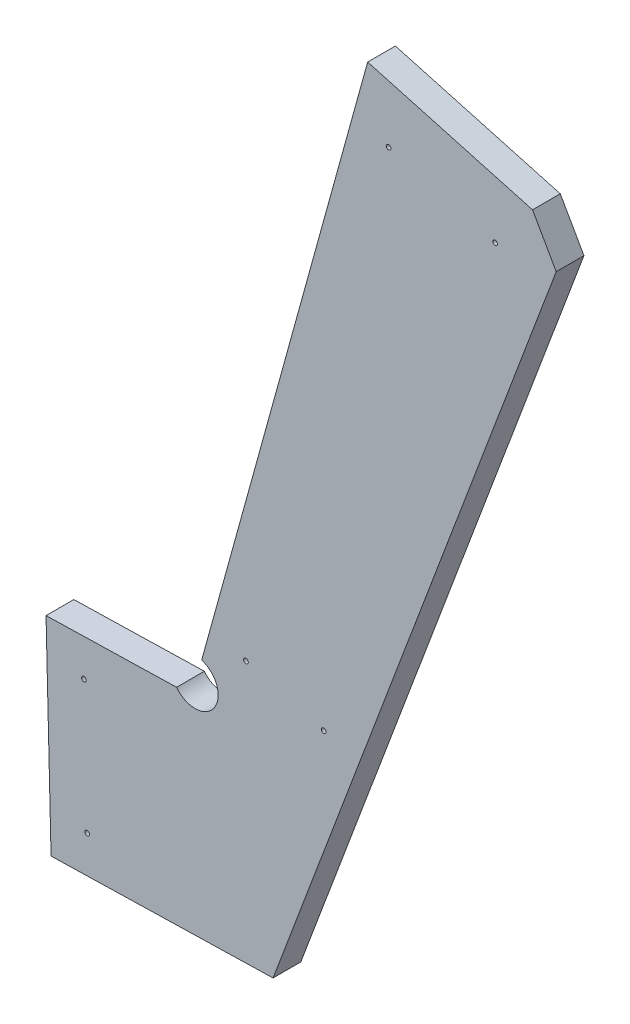
ISO-10303-21;
HEADER;
FILE_DESCRIPTION(('STEP AP214'),'2;1');
FILE_NAME('part.step','',(''),(''),'','','');
FILE_SCHEMA(('AUTOMOTIVE_DESIGN { 1 0 10303 214 1 1 1 1 }'));
ENDSEC;
DATA;
#1=APPLICATION_CONTEXT('core data for automotive mechanical design processes');
#2=APPLICATION_PROTOCOL_DEFINITION('international standard','automotive_design',2000,#1);
#3=PRODUCT_CONTEXT('',#1,'mechanical');
#4=PRODUCT('Part','Part','',(#3));
#5=PRODUCT_RELATED_PRODUCT_CATEGORY('part','',(#4));
#6=PRODUCT_DEFINITION_FORMATION('','',#4);
#7=PRODUCT_DEFINITION_CONTEXT('part definition',#1,'design');
#8=PRODUCT_DEFINITION('design','',#6,#7);
#9=PRODUCT_DEFINITION_SHAPE('','',#8);
#10=(LENGTH_UNIT() NAMED_UNIT(*) SI_UNIT(.MILLI.,.METRE.));
#11=(NAMED_UNIT(*) PLANE_ANGLE_UNIT() SI_UNIT($,.RADIAN.));
#12=(NAMED_UNIT(*) SI_UNIT($,.STERADIAN.) SOLID_ANGLE_UNIT());
#13=UNCERTAINTY_MEASURE_WITH_UNIT(LENGTH_MEASURE(1.E-05),#10,'distance_accuracy_value','');
#14=(GEOMETRIC_REPRESENTATION_CONTEXT(3) GLOBAL_UNCERTAINTY_ASSIGNED_CONTEXT((#13)) GLOBAL_UNIT_ASSIGNED_CONTEXT((#10,
#11,#12)) REPRESENTATION_CONTEXT('',''));
#15=CARTESIAN_POINT('',(0.,0.,0.));
#16=DIRECTION('',(0.,0.,1.));
#17=DIRECTION('',(1.,0.,0.));
#18=AXIS2_PLACEMENT_3D('',#15,#16,#17);
#19=CARTESIAN_POINT('',(175.093421906188,-22.8896132008156,19.05));
#20=DIRECTION('',(0.963909776161033,-0.266229118281957,0.));
#21=DIRECTION('',(0.266229118281958,0.963909776161034,0.));
#22=AXIS2_PLACEMENT_3D('',#19,#20,#21);
#23=PLANE('',#22);
#24=CARTESIAN_POINT('',(145.805415389945,-128.929838956195,9.52499999999995));
#25=DIRECTION('',(0.963909776161033,-0.266229118281957,0.));
#26=DIRECTION('',(0.266229118281958,0.963909776161034,0.));
#27=AXIS2_PLACEMENT_3D('',#24,#25,#26);
#28=CIRCLE('',#27,1.5875);
#29=CARTESIAN_POINT('',(146.228054115217,-127.399632186539,9.52499999999995));
#30=VERTEX_POINT('',#29);
#31=EDGE_CURVE('E171',#30,#30,#28,.T.);
#32=ORIENTED_EDGE('',*,*,#31,.T.);
#33=EDGE_LOOP('',(#32));
#34=FACE_BOUND('',#33,.T.);
#35=CARTESIAN_POINT('',(87.2294023574525,-341.010290466976,9.52500000000001));
#36=DIRECTION('',(0.963909776161033,-0.266229118281957,0.));
#37=DIRECTION('',(0.266229118281958,0.963909776161034,0.));
#38=AXIS2_PLACEMENT_3D('',#35,#36,#37);
#39=CIRCLE('',#38,1.5875);
#40=CARTESIAN_POINT('',(87.6520410827251,-339.480083697321,9.52500000000001));
#41=VERTEX_POINT('',#40);
#42=EDGE_CURVE('E145',#41,#41,#39,.T.);
#43=ORIENTED_EDGE('',*,*,#42,.T.);
#44=EDGE_LOOP('',(#43));
#45=FACE_BOUND('',#44,.T.);
#46=DIRECTION('',(-0.266229118281958,-0.963909776161035,0.));
#47=VECTOR('',#46,1.);
#48=CARTESIAN_POINT('',(175.093421906187,-22.8896132008155,0.));
#49=LINE('',#48,#47);
#50=CARTESIAN_POINT('',(175.093421906187,-22.8896132008155,0.));
#51=VERTEX_POINT('',#50);
#52=CARTESIAN_POINT('',(61.1778172413202,-435.332721236312,0.));
#53=VERTEX_POINT('',#52);
#54=EDGE_CURVE('E141',#51,#53,#49,.T.);
#55=ORIENTED_EDGE('',*,*,#54,.T.);
#56=DIRECTION('',(0.,0.,-0.99999999999999));
#57=VECTOR('',#56,1.);
#58=CARTESIAN_POINT('',(61.1778172413202,-435.332721236312,19.0500000000001));
#59=LINE('',#58,#57);
#60=CARTESIAN_POINT('',(61.1778172413202,-435.332721236312,19.0500000000001));
#61=VERTEX_POINT('',#60);
#62=EDGE_CURVE('E11',#61,#53,#59,.T.);
#63=ORIENTED_EDGE('',*,*,#62,.F.);
#64=DIRECTION('',(-0.266229118281958,-0.963909776161035,0.));
#65=VECTOR('',#64,1.);
#66=CARTESIAN_POINT('',(175.093421906188,-22.8896132008156,19.05));
#67=LINE('',#66,#65);
#68=CARTESIAN_POINT('',(175.093421906188,-22.8896132008156,19.05));
#69=VERTEX_POINT('',#68);
#70=EDGE_CURVE('E156',#69,#61,#67,.T.);
#71=ORIENTED_EDGE('',*,*,#70,.F.);
#72=DIRECTION('',(0.,0.,-0.99999999999999));
#73=VECTOR('',#72,1.);
#74=CARTESIAN_POINT('',(175.093421906188,-22.8896132008156,19.05));
#75=LINE('',#74,#73);
#76=EDGE_CURVE('E137',#69,#51,#75,.T.);
#77=ORIENTED_EDGE('',*,*,#76,.T.);
#78=EDGE_LOOP('',(#55,#63,#71,#77));
#79=FACE_BOUND('',#78,.T.);
#80=ADVANCED_FACE('F40',(#34,#45,#79),#23,.F.);
#81=CARTESIAN_POINT('',(56.6289305096282,-450.542035964539,19.05));
#82=DIRECTION('',(0.,0.,-0.99999999999999));
#83=DIRECTION('',(-1.,0.,0.));
#84=AXIS2_PLACEMENT_3D('',#81,#82,#83);
#85=CYLINDRICAL_SURFACE('',#84,15.875);
#86=CARTESIAN_POINT('',(56.6289305096282,-450.542035964539,1.66533453693773E-13));
#87=DIRECTION('',(0.,0.,-0.99999999999999));
#88=DIRECTION('',(1.,0.,0.));
#89=AXIS2_PLACEMENT_3D('',#86,#87,#88);
#90=CIRCLE('',#89,15.875);
#91=CARTESIAN_POINT('',(43.9506406577059,-460.095914309518,1.66533453693773E-13));
#92=VERTEX_POINT('',#91);
#93=EDGE_CURVE('E144',#53,#92,#90,.T.);
#94=ORIENTED_EDGE('',*,*,#93,.T.);
#95=DIRECTION('',(0.,0.,-0.99999999999999));
#96=VECTOR('',#95,1.);
#97=CARTESIAN_POINT('',(43.9506406577061,-460.095914309517,19.0499999999999));
#98=LINE('',#97,#96);
#99=CARTESIAN_POINT('',(43.9506406577061,-460.095914309517,19.0499999999999));
#100=VERTEX_POINT('',#99);
#101=EDGE_CURVE('E49',#100,#92,#98,.T.);
#102=ORIENTED_EDGE('',*,*,#101,.F.);
#103=CARTESIAN_POINT('',(56.6289305096282,-450.542035964539,19.05));
#104=DIRECTION('',(0.,0.,-0.99999999999999));
#105=DIRECTION('',(1.,0.,0.));
#106=AXIS2_PLACEMENT_3D('',#103,#104,#105);
#107=CIRCLE('',#106,15.875);
#108=EDGE_CURVE('E102',#61,#100,#107,.T.);
#109=ORIENTED_EDGE('',*,*,#108,.F.);
#110=ORIENTED_EDGE('',*,*,#62,.T.);
#111=EDGE_LOOP('',(#94,#102,#109,#110));
#112=FACE_BOUND('',#111,.T.);
#113=ADVANCED_FACE('F239',(#112),#85,.F.);
#114=CARTESIAN_POINT('',(43.9506406577061,-460.095914309517,19.0499999999999));
#115=DIRECTION('',(0.024409764919273,-0.999702037297409,0.));
#116=DIRECTION('',(0.999702037297407,0.0244097649192753,0.));
#117=AXIS2_PLACEMENT_3D('',#114,#115,#116);
#118=PLANE('',#117);
#119=DIRECTION('',(-0.999702037297407,-0.0244097649192753,0.));
#120=VECTOR('',#119,1.);
#121=CARTESIAN_POINT('',(43.9506406577059,-460.095914309518,1.66533453693773E-13));
#122=LINE('',#121,#120);
#123=CARTESIAN_POINT('',(-45.6456549562086,-462.283590669051,1.11022302462516E-13));
#124=VERTEX_POINT('',#123);
#125=EDGE_CURVE('E147',#92,#124,#122,.T.);
#126=ORIENTED_EDGE('',*,*,#125,.T.);
#127=DIRECTION('',(0.,0.,-0.99999999999999));
#128=VECTOR('',#127,1.);
#129=CARTESIAN_POINT('',(-45.6456549562085,-462.283590669051,19.05));
#130=LINE('',#129,#128);
#131=CARTESIAN_POINT('',(-45.6456549562085,-462.283590669051,19.05));
#132=VERTEX_POINT('',#131);
#133=EDGE_CURVE('E163',#132,#124,#130,.T.);
#134=ORIENTED_EDGE('',*,*,#133,.F.);
#135=DIRECTION('',(-0.999702037297407,-0.0244097649192753,0.));
#136=VECTOR('',#135,1.);
#137=CARTESIAN_POINT('',(43.9506406577061,-460.095914309517,19.0499999999999));
#138=LINE('',#137,#136);
#139=EDGE_CURVE('E207',#100,#132,#138,.T.);
#140=ORIENTED_EDGE('',*,*,#139,.F.);
#141=ORIENTED_EDGE('',*,*,#101,.T.);
#142=EDGE_LOOP('',(#126,#134,#140,#141));
#143=FACE_BOUND('',#142,.T.);
#144=ADVANCED_FACE('F244',(#143),#118,.F.);
#145=CARTESIAN_POINT('',(-45.6456549562085,-462.283590669051,19.05));
#146=DIRECTION('',(0.999702037297407,0.0244097649192753,0.));
#147=DIRECTION('',(-0.0244097649192738,0.999702037297409,0.));
#148=AXIS2_PLACEMENT_3D('',#145,#146,#147);
#149=PLANE('',#148);
#150=DIRECTION('',(0.0244097649192732,-0.999702037297409,0.));
#151=VECTOR('',#150,1.);
#152=CARTESIAN_POINT('',(-45.6456549562086,-462.283590669051,1.11022302462516E-13));
#153=LINE('',#152,#151);
#154=CARTESIAN_POINT('',(-42.1968514560684,-603.529354269427,1.13797860024079E-12));
#155=VERTEX_POINT('',#154);
#156=EDGE_CURVE('E149',#124,#155,#153,.T.);
#157=ORIENTED_EDGE('',*,*,#156,.T.);
#158=DIRECTION('',(0.,0.,-0.99999999999999));
#159=VECTOR('',#158,1.);
#160=CARTESIAN_POINT('',(-42.1968514560683,-603.529354269427,19.0500000000001));
#161=LINE('',#160,#159);
#162=CARTESIAN_POINT('',(-42.1968514560683,-603.529354269427,19.0500000000001));
#163=VERTEX_POINT('',#162);
#164=EDGE_CURVE('E160',#163,#155,#161,.T.);
#165=ORIENTED_EDGE('',*,*,#164,.F.);
#166=DIRECTION('',(0.0244097649192732,-0.999702037297409,0.));
#167=VECTOR('',#166,1.);
#168=CARTESIAN_POINT('',(-45.6456549562085,-462.283590669051,19.05));
#169=LINE('',#168,#167);
#170=EDGE_CURVE('E209',#132,#163,#169,.T.);
#171=ORIENTED_EDGE('',*,*,#170,.F.);
#172=ORIENTED_EDGE('',*,*,#133,.T.);
#173=EDGE_LOOP('',(#157,#165,#171,#172));
#174=FACE_BOUND('',#173,.T.);
#175=ADVANCED_FACE('F215',(#174),#149,.F.);
#176=CARTESIAN_POINT('',(-42.1968514560683,-603.529354269427,19.0500000000001));
#177=DIRECTION('',(-0.0244097649192896,0.99970203729741,0.));
#178=DIRECTION('',(-0.999702037297408,-0.0244097649192914,0.));
#179=AXIS2_PLACEMENT_3D('',#176,#177,#178);
#180=PLANE('',#179);
#181=DIRECTION('',(0.999702037297408,0.0244097649192914,0.));
#182=VECTOR('',#181,1.);
#183=CARTESIAN_POINT('',(-42.1968514560684,-603.529354269427,1.13797860024079E-12));
#184=LINE('',#183,#182);
#185=CARTESIAN_POINT('',(110.157739028056,-599.809306095727,0.));
#186=VERTEX_POINT('',#185);
#187=EDGE_CURVE('E151',#155,#186,#184,.T.);
#188=ORIENTED_EDGE('',*,*,#187,.T.);
#189=DIRECTION('',(0.,0.,-0.99999999999999));
#190=VECTOR('',#189,1.);
#191=CARTESIAN_POINT('',(110.157739028056,-599.809306095727,19.0500000000001));
#192=LINE('',#191,#190);
#193=CARTESIAN_POINT('',(110.157739028056,-599.809306095727,19.0500000000001));
#194=VERTEX_POINT('',#193);
#195=EDGE_CURVE('E132',#194,#186,#192,.T.);
#196=ORIENTED_EDGE('',*,*,#195,.F.);
#197=DIRECTION('',(0.999702037297408,0.0244097649192914,0.));
#198=VECTOR('',#197,1.);
#199=CARTESIAN_POINT('',(-42.1968514560683,-603.529354269427,19.0500000000001));
#200=LINE('',#199,#198);
#201=EDGE_CURVE('E123',#163,#194,#200,.T.);
#202=ORIENTED_EDGE('',*,*,#201,.F.);
#203=ORIENTED_EDGE('',*,*,#164,.T.);
#204=EDGE_LOOP('',(#188,#196,#202,#203));
#205=FACE_BOUND('',#204,.T.);
#206=ADVANCED_FACE('F219',(#205),#180,.F.);
#207=CARTESIAN_POINT('',(110.157739028056,-599.809306095727,19.0500000000001));
#208=DIRECTION('',(-0.936051647242177,0.351862634695996,0.));
#209=DIRECTION('',(-0.351862634695998,-0.936051647242178,0.));
#210=AXIS2_PLACEMENT_3D('',#207,#208,#209);
#211=PLANE('',#210);
#212=DIRECTION('',(0.351862634695998,0.936051647242178,0.));
#213=VECTOR('',#212,1.);
#214=CARTESIAN_POINT('',(110.157739028056,-599.809306095727,0.));
#215=LINE('',#214,#213);
#216=CARTESIAN_POINT('',(304.502022378634,-82.7999148610456,1.2490009027033E-12));
#217=VERTEX_POINT('',#216);
#218=EDGE_CURVE('E131',#186,#217,#215,.T.);
#219=ORIENTED_EDGE('',*,*,#218,.T.);
#220=DIRECTION('',(0.,0.,-0.99999999999999));
#221=VECTOR('',#220,1.);
#222=CARTESIAN_POINT('',(304.502022378634,-82.7999148610458,19.0500000000011));
#223=LINE('',#222,#221);
#224=CARTESIAN_POINT('',(304.502022378634,-82.7999148610458,19.0500000000011));
#225=VERTEX_POINT('',#224);
#226=EDGE_CURVE('E128',#225,#217,#223,.T.);
#227=ORIENTED_EDGE('',*,*,#226,.F.);
#228=DIRECTION('',(0.351862634695998,0.936051647242178,0.));
#229=VECTOR('',#228,1.);
#230=CARTESIAN_POINT('',(110.157739028056,-599.809306095727,19.0500000000001));
#231=LINE('',#230,#229);
#232=EDGE_CURVE('E117',#194,#225,#231,.T.);
#233=ORIENTED_EDGE('',*,*,#232,.F.);
#234=ORIENTED_EDGE('',*,*,#195,.T.);
#235=EDGE_LOOP('',(#219,#227,#233,#234));
#236=FACE_BOUND('',#235,.T.);
#237=ADVANCED_FACE('F129',(#236),#211,.F.);
#238=CARTESIAN_POINT('',(304.502022378634,-82.7999148610458,19.0500000000011));
#239=DIRECTION('',(-0.869839554061961,-0.493334724288988,0.));
#240=DIRECTION('',(0.493334724288986,-0.869839554061961,0.));
#241=AXIS2_PLACEMENT_3D('',#238,#239,#240);
#242=PLANE('',#241);
#243=DIRECTION('',(-0.493334724288986,0.869839554061961,0.));
#244=VECTOR('',#243,1.);
#245=CARTESIAN_POINT('',(304.502022378634,-82.7999148610456,1.2490009027033E-12));
#246=LINE('',#245,#244);
#247=CARTESIAN_POINT('',(288.249001777841,-54.1428601363266,2.22044604925031E-13));
#248=VERTEX_POINT('',#247);
#249=EDGE_CURVE('E88',#217,#248,#246,.T.);
#250=ORIENTED_EDGE('',*,*,#249,.T.);
#251=DIRECTION('',(0.,0.,-0.99999999999999));
#252=VECTOR('',#251,1.);
#253=CARTESIAN_POINT('',(288.249001777841,-54.1428601363266,19.0500000000002));
#254=LINE('',#253,#252);
#255=CARTESIAN_POINT('',(288.249001777841,-54.1428601363266,19.0500000000002));
#256=VERTEX_POINT('',#255);
#257=EDGE_CURVE('E133',#256,#248,#254,.T.);
#258=ORIENTED_EDGE('',*,*,#257,.F.);
#259=DIRECTION('',(-0.493334724288986,0.869839554061961,0.));
#260=VECTOR('',#259,1.);
#261=CARTESIAN_POINT('',(304.502022378634,-82.7999148610458,19.0500000000011));
#262=LINE('',#261,#260);
#263=EDGE_CURVE('E121',#225,#256,#262,.T.);
#264=ORIENTED_EDGE('',*,*,#263,.F.);
#265=ORIENTED_EDGE('',*,*,#226,.T.);
#266=EDGE_LOOP('',(#250,#258,#264,#265));
#267=FACE_BOUND('',#266,.T.);
#268=ADVANCED_FACE('F135',(#267),#242,.F.);
#269=CARTESIAN_POINT('',(288.249001777841,-54.1428601363266,19.0500000000002));
#270=DIRECTION('',(-0.266229118281959,-0.963909776161036,0.));
#271=DIRECTION('',(0.963909776161033,-0.266229118281958,0.));
#272=AXIS2_PLACEMENT_3D('',#269,#270,#271);
#273=PLANE('',#272);
#274=DIRECTION('',(-0.963909776161033,0.266229118281958,0.));
#275=VECTOR('',#274,1.);
#276=CARTESIAN_POINT('',(288.249001777841,-54.1428601363266,2.22044604925031E-13));
#277=LINE('',#276,#275);
#278=EDGE_CURVE('E94',#248,#51,#277,.T.);
#279=ORIENTED_EDGE('',*,*,#278,.T.);
#280=ORIENTED_EDGE('',*,*,#76,.F.);
#281=DIRECTION('',(-0.963909776161033,0.266229118281958,0.));
#282=VECTOR('',#281,1.);
#283=CARTESIAN_POINT('',(288.249001777841,-54.1428601363266,19.0500000000002));
#284=LINE('',#283,#282);
#285=EDGE_CURVE('E58',#256,#69,#284,.T.);
#286=ORIENTED_EDGE('',*,*,#285,.F.);
#287=ORIENTED_EDGE('',*,*,#257,.T.);
#288=EDGE_LOOP('',(#279,#280,#286,#287));
#289=FACE_BOUND('',#288,.T.);
#290=ADVANCED_FACE('F227',(#289),#273,.F.);
#291=CARTESIAN_POINT('',(56.6289305096282,-450.542035964539,19.05));
#292=DIRECTION('',(0.,0.,0.99999999999999));
#293=DIRECTION('',(1.,0.,0.));
#294=AXIS2_PLACEMENT_3D('',#291,#292,#293);
#295=PLANE('',#294);
#296=CARTESIAN_POINT('',(189.433400814135,-66.3767952769127,19.0500000000002));
#297=DIRECTION('',(0.,0.,-0.99999999999999));
#298=DIRECTION('',(0.,1.,0.));
#299=AXIS2_PLACEMENT_3D('',#296,#297,#298);
#300=CIRCLE('',#299,1.58749999999999);
#301=CARTESIAN_POINT('',(189.433400814135,-64.7892952769127,19.0500000000002));
#302=VERTEX_POINT('',#301);
#303=EDGE_CURVE('E299',#302,#302,#300,.T.);
#304=ORIENTED_EDGE('',*,*,#303,.T.);
#305=EDGE_LOOP('',(#304));
#306=FACE_BOUND('',#305,.T.);
#307=CARTESIAN_POINT('',(262.546804291451,-86.5705078252816,19.0500000000002));
#308=DIRECTION('',(0.,0.,-0.99999999999999));
#309=DIRECTION('',(0.,1.,0.));
#310=AXIS2_PLACEMENT_3D('',#307,#308,#309);
#311=CIRCLE('',#310,1.58750000000002);
#312=CARTESIAN_POINT('',(262.546804291451,-84.9830078252816,19.0500000000002));
#313=VERTEX_POINT('',#312);
#314=EDGE_CURVE('E302',#313,#313,#311,.T.);
#315=ORIENTED_EDGE('',*,*,#314,.T.);
#316=EDGE_LOOP('',(#315));
#317=FACE_BOUND('',#316,.T.);
#318=CARTESIAN_POINT('',(91.5790119553588,-420.668627327162,19.0500000000032));
#319=DIRECTION('',(0.,0.,-0.99999999999999));
#320=DIRECTION('',(0.,1.,0.));
#321=AXIS2_PLACEMENT_3D('',#318,#319,#320);
#322=CIRCLE('',#321,1.58750000000001);
#323=CARTESIAN_POINT('',(91.5790119553588,-419.081127327162,19.0500000000032));
#324=VERTEX_POINT('',#323);
#325=EDGE_CURVE('E195',#324,#324,#322,.T.);
#326=ORIENTED_EDGE('',*,*,#325,.T.);
#327=EDGE_LOOP('',(#326));
#328=FACE_BOUND('',#327,.T.);
#329=CARTESIAN_POINT('',(144.932354166902,-435.404667572491,19.0500000000035));
#330=DIRECTION('',(0.,0.,-0.99999999999999));
#331=DIRECTION('',(0.,1.,0.));
#332=AXIS2_PLACEMENT_3D('',#329,#330,#331);
#333=CIRCLE('',#332,1.58749999999999);
#334=CARTESIAN_POINT('',(144.932354166902,-433.817167572491,19.0500000000035));
#335=VERTEX_POINT('',#334);
#336=EDGE_CURVE('E184',#335,#335,#333,.T.);
#337=ORIENTED_EDGE('',*,*,#336,.T.);
#338=EDGE_LOOP('',(#337));
#339=FACE_BOUND('',#338,.T.);
#340=CARTESIAN_POINT('',(-19.6332151798984,-487.056014387455,19.0500000000043));
#341=DIRECTION('',(0.,0.,-0.99999999999999));
#342=DIRECTION('',(0.,1.,0.));
#343=AXIS2_PLACEMENT_3D('',#340,#341,#342);
#344=CIRCLE('',#343,1.5875);
#345=CARTESIAN_POINT('',(-19.6332151798984,-485.468514387455,19.0500000000043));
#346=VERTEX_POINT('',#345);
#347=EDGE_CURVE('E181',#346,#346,#344,.T.);
#348=ORIENTED_EDGE('',*,*,#347,.T.);
#349=EDGE_LOOP('',(#348));
#350=FACE_BOUND('',#349,.T.);
#351=CARTESIAN_POINT('',(-17.4244277376567,-577.516914493122,19.0500000000048));
#352=DIRECTION('',(0.,0.,-0.99999999999999));
#353=DIRECTION('',(0.,1.,0.));
#354=AXIS2_PLACEMENT_3D('',#351,#352,#353);
#355=CIRCLE('',#354,1.5875);
#356=CARTESIAN_POINT('',(-17.4244277376567,-575.929414493123,19.0500000000047));
#357=VERTEX_POINT('',#356);
#358=EDGE_CURVE('E178',#357,#357,#355,.T.);
#359=ORIENTED_EDGE('',*,*,#358,.T.);
#360=EDGE_LOOP('',(#359));
#361=FACE_BOUND('',#360,.T.);
#362=ORIENTED_EDGE('',*,*,#70,.T.);
#363=ORIENTED_EDGE('',*,*,#108,.T.);
#364=ORIENTED_EDGE('',*,*,#139,.T.);
#365=ORIENTED_EDGE('',*,*,#170,.T.);
#366=ORIENTED_EDGE('',*,*,#201,.T.);
#367=ORIENTED_EDGE('',*,*,#232,.T.);
#368=ORIENTED_EDGE('',*,*,#263,.T.);
#369=ORIENTED_EDGE('',*,*,#285,.T.);
#370=EDGE_LOOP('',(#362,#363,#364,#365,#366,#367,#368,#369));
#371=FACE_BOUND('',#370,.T.);
#372=ADVANCED_FACE('F119',(#306,#317,#328,#339,#350,#361,#371),#295,.T.);
#373=CARTESIAN_POINT('',(56.6289305096282,-450.542035964539,1.66533453693773E-13));
#374=DIRECTION('',(0.,0.,0.99999999999999));
#375=DIRECTION('',(1.,0.,0.));
#376=AXIS2_PLACEMENT_3D('',#373,#374,#375);
#377=PLANE('',#376);
#378=CARTESIAN_POINT('',(189.433400814135,-66.3767952769127,0.));
#379=DIRECTION('',(0.,0.,0.99999999999999));
#380=DIRECTION('',(1.,0.,0.));
#381=AXIS2_PLACEMENT_3D('',#378,#379,#380);
#382=CIRCLE('',#381,1.58749999999999);
#383=CARTESIAN_POINT('',(191.020900814135,-66.3767952769127,0.));
#384=VERTEX_POINT('',#383);
#385=EDGE_CURVE('E43',#384,#384,#382,.T.);
#386=ORIENTED_EDGE('',*,*,#385,.T.);
#387=EDGE_LOOP('',(#386));
#388=FACE_BOUND('',#387,.T.);
#389=CARTESIAN_POINT('',(262.546804291451,-86.5705078252818,9.71445146547012E-13));
#390=DIRECTION('',(0.,0.,0.99999999999999));
#391=DIRECTION('',(1.,0.,0.));
#392=AXIS2_PLACEMENT_3D('',#389,#390,#391);
#393=CIRCLE('',#392,1.58750000000002);
#394=CARTESIAN_POINT('',(264.134304291451,-86.5705078252818,9.72285214294182E-13));
#395=VERTEX_POINT('',#394);
#396=EDGE_CURVE('E304',#395,#395,#393,.T.);
#397=ORIENTED_EDGE('',*,*,#396,.T.);
#398=EDGE_LOOP('',(#397));
#399=FACE_BOUND('',#398,.T.);
#400=CARTESIAN_POINT('',(91.5790119553588,-420.668627327162,1.66533453693773E-13));
#401=DIRECTION('',(0.,0.,0.99999999999999));
#402=DIRECTION('',(1.,0.,0.));
#403=AXIS2_PLACEMENT_3D('',#400,#401,#402);
#404=CIRCLE('',#403,1.58750000000001);
#405=CARTESIAN_POINT('',(93.1665119553588,-420.668627327162,1.67373521440944E-13));
#406=VERTEX_POINT('',#405);
#407=EDGE_CURVE('E190',#406,#406,#404,.T.);
#408=ORIENTED_EDGE('',*,*,#407,.T.);
#409=EDGE_LOOP('',(#408));
#410=FACE_BOUND('',#409,.T.);
#411=CARTESIAN_POINT('',(144.932354166901,-435.404667572491,1.11022302462516E-13));
#412=DIRECTION('',(0.,0.,0.99999999999999));
#413=DIRECTION('',(1.,0.,0.));
#414=AXIS2_PLACEMENT_3D('',#411,#412,#413);
#415=CIRCLE('',#414,1.58749999999999);
#416=CARTESIAN_POINT('',(146.519854166901,-435.404667572491,1.11862370209686E-13));
#417=VERTEX_POINT('',#416);
#418=EDGE_CURVE('E182',#417,#417,#415,.T.);
#419=ORIENTED_EDGE('',*,*,#418,.T.);
#420=EDGE_LOOP('',(#419));
#421=FACE_BOUND('',#420,.T.);
#422=CARTESIAN_POINT('',(-19.6332151798987,-487.056014387455,9.71445146547012E-13));
#423=DIRECTION('',(0.,0.,0.99999999999999));
#424=DIRECTION('',(1.,0.,0.));
#425=AXIS2_PLACEMENT_3D('',#422,#423,#424);
#426=CIRCLE('',#425,1.5875);
#427=CARTESIAN_POINT('',(-18.0457151798987,-487.056014387455,9.72285214294182E-13));
#428=VERTEX_POINT('',#427);
#429=EDGE_CURVE('E179',#428,#428,#426,.T.);
#430=ORIENTED_EDGE('',*,*,#429,.T.);
#431=EDGE_LOOP('',(#430));
#432=FACE_BOUND('',#431,.T.);
#433=CARTESIAN_POINT('',(-17.4244277376563,-577.516914493123,-1.11022302462516E-13));
#434=DIRECTION('',(0.,0.,0.99999999999999));
#435=DIRECTION('',(1.,0.,0.));
#436=AXIS2_PLACEMENT_3D('',#433,#434,#435);
#437=CIRCLE('',#436,1.5875);
#438=CARTESIAN_POINT('',(-15.8369277376563,-577.516914493123,-1.10182234715345E-13));
#439=VERTEX_POINT('',#438);
#440=EDGE_CURVE('E175',#439,#439,#437,.T.);
#441=ORIENTED_EDGE('',*,*,#440,.T.);
#442=EDGE_LOOP('',(#441));
#443=FACE_BOUND('',#442,.T.);
#444=ORIENTED_EDGE('',*,*,#54,.F.);
#445=ORIENTED_EDGE('',*,*,#278,.F.);
#446=ORIENTED_EDGE('',*,*,#249,.F.);
#447=ORIENTED_EDGE('',*,*,#218,.F.);
#448=ORIENTED_EDGE('',*,*,#187,.F.);
#449=ORIENTED_EDGE('',*,*,#156,.F.);
#450=ORIENTED_EDGE('',*,*,#125,.F.);
#451=ORIENTED_EDGE('',*,*,#93,.F.);
#452=EDGE_LOOP('',(#444,#445,#446,#447,#448,#449,#450,#451));
#453=FACE_BOUND('',#452,.T.);
#454=ADVANCED_FACE('F222',(#388,#399,#410,#421,#432,#443,#453),#377,.F.);
#455=CARTESIAN_POINT('',(74.9877482002178,-337.629180664798,9.52499999999995));
#456=DIRECTION('',(-0.963909776161034,0.266229118281957,0.));
#457=DIRECTION('',(-0.266229118281958,-0.963909776161034,0.));
#458=AXIS2_PLACEMENT_3D('',#455,#456,#457);
#459=CYLINDRICAL_SURFACE('',#458,1.5875);
#460=CARTESIAN_POINT('',(105.591883593331,-346.08195517025,9.52499999999976));
#461=DIRECTION('',(-0.963909776161034,0.266229118281957,0.));
#462=DIRECTION('',(-0.266229118281958,-0.963909776161034,0.));
#463=AXIS2_PLACEMENT_3D('',#460,#461,#462);
#464=CIRCLE('',#463,1.5875);
#465=CARTESIAN_POINT('',(105.169244868058,-347.612161939905,9.52499999999976));
#466=VERTEX_POINT('',#465);
#467=EDGE_CURVE('E170',#466,#466,#464,.T.);
#468=ORIENTED_EDGE('',*,*,#467,.F.);
#469=EDGE_LOOP('',(#468));
#470=FACE_BOUND('',#469,.T.);
#471=ORIENTED_EDGE('',*,*,#42,.F.);
#472=EDGE_LOOP('',(#471));
#473=FACE_BOUND('',#472,.T.);
#474=ADVANCED_FACE('F249',(#470,#473),#459,.F.);
#475=CARTESIAN_POINT('',(105.591883593331,-346.08195517025,9.52499999999976));
#476=DIRECTION('',(-0.963909776161034,0.266229118281957,0.));
#477=DIRECTION('',(-0.266229118281958,-0.963909776161034,0.));
#478=AXIS2_PLACEMENT_3D('',#475,#476,#477);
#479=CONICAL_SURFACE('',#478,1.5875,1.02974425867665);
#480=CARTESIAN_POINT('',(106.511324580186,-346.335902136343,9.52499999999981));
#481=VERTEX_POINT('',#480);
#482=VERTEX_LOOP('',#481);
#483=FACE_BOUND('',#482,.T.);
#484=ORIENTED_EDGE('',*,*,#467,.T.);
#485=EDGE_LOOP('',(#484));
#486=FACE_BOUND('',#485,.T.);
#487=ADVANCED_FACE('F251',(#483,#486),#479,.F.);
#488=CARTESIAN_POINT('',(133.56376123271,-125.548729154017,9.5249999999999));
#489=DIRECTION('',(-0.963909776161034,0.266229118281957,0.));
#490=DIRECTION('',(-0.266229118281958,-0.963909776161034,0.));
#491=AXIS2_PLACEMENT_3D('',#488,#489,#490);
#492=CYLINDRICAL_SURFACE('',#491,1.5875);
#493=CARTESIAN_POINT('',(164.167896625823,-134.001503659469,9.52499999999995));
#494=DIRECTION('',(-0.963909776161034,0.266229118281957,0.));
#495=DIRECTION('',(-0.266229118281958,-0.963909776161034,0.));
#496=AXIS2_PLACEMENT_3D('',#493,#494,#495);
#497=CIRCLE('',#496,1.5875);
#498=CARTESIAN_POINT('',(163.74525790055,-135.531710429125,9.52499999999995));
#499=VERTEX_POINT('',#498);
#500=EDGE_CURVE('E174',#499,#499,#497,.T.);
#501=ORIENTED_EDGE('',*,*,#500,.F.);
#502=EDGE_LOOP('',(#501));
#503=FACE_BOUND('',#502,.T.);
#504=ORIENTED_EDGE('',*,*,#31,.F.);
#505=EDGE_LOOP('',(#504));
#506=FACE_BOUND('',#505,.T.);
#507=ADVANCED_FACE('F258',(#503,#506),#492,.F.);
#508=CARTESIAN_POINT('',(164.167896625823,-134.001503659469,9.52499999999995));
#509=DIRECTION('',(-0.963909776161034,0.266229118281957,0.));
#510=DIRECTION('',(-0.266229118281958,-0.963909776161034,0.));
#511=AXIS2_PLACEMENT_3D('',#508,#509,#510);
#512=CONICAL_SURFACE('',#511,1.5875,1.02974425867665);
#513=CARTESIAN_POINT('',(165.087337612678,-134.255450625561,9.52499999999978));
#514=VERTEX_POINT('',#513);
#515=VERTEX_LOOP('',#514);
#516=FACE_BOUND('',#515,.T.);
#517=ORIENTED_EDGE('',*,*,#500,.T.);
#518=EDGE_LOOP('',(#517));
#519=FACE_BOUND('',#518,.T.);
#520=ADVANCED_FACE('F264',(#516,#519),#512,.F.);
#521=CARTESIAN_POINT('',(-17.4244277376563,-577.516914493123,-19.049999999995));
#522=DIRECTION('',(0.,0.,-0.99999999999999));
#523=DIRECTION('',(0.,1.,0.));
#524=AXIS2_PLACEMENT_3D('',#521,#522,#523);
#525=CYLINDRICAL_SURFACE('',#524,1.5875);
#526=ORIENTED_EDGE('',*,*,#358,.F.);
#527=EDGE_LOOP('',(#526));
#528=FACE_BOUND('',#527,.T.);
#529=ORIENTED_EDGE('',*,*,#440,.F.);
#530=EDGE_LOOP('',(#529));
#531=FACE_BOUND('',#530,.T.);
#532=ADVANCED_FACE('F267',(#528,#531),#525,.F.);
#533=CARTESIAN_POINT('',(-19.6332151798994,-487.056014387456,-19.0499999999945));
#534=DIRECTION('',(0.,0.,-0.99999999999999));
#535=DIRECTION('',(0.,1.,0.));
#536=AXIS2_PLACEMENT_3D('',#533,#534,#535);
#537=CYLINDRICAL_SURFACE('',#536,1.5875);
#538=ORIENTED_EDGE('',*,*,#347,.F.);
#539=EDGE_LOOP('',(#538));
#540=FACE_BOUND('',#539,.T.);
#541=ORIENTED_EDGE('',*,*,#429,.F.);
#542=EDGE_LOOP('',(#541));
#543=FACE_BOUND('',#542,.T.);
#544=ADVANCED_FACE('F274',(#540,#543),#537,.F.);
#545=CARTESIAN_POINT('',(144.932354166901,-435.404667572491,-19.0499999999964));
#546=DIRECTION('',(0.,0.,-0.99999999999999));
#547=DIRECTION('',(0.,1.,0.));
#548=AXIS2_PLACEMENT_3D('',#545,#546,#547);
#549=CYLINDRICAL_SURFACE('',#548,1.58749999999999);
#550=ORIENTED_EDGE('',*,*,#336,.F.);
#551=EDGE_LOOP('',(#550));
#552=FACE_BOUND('',#551,.T.);
#553=ORIENTED_EDGE('',*,*,#418,.F.);
#554=EDGE_LOOP('',(#553));
#555=FACE_BOUND('',#554,.T.);
#556=ADVANCED_FACE('F278',(#552,#555),#549,.F.);
#557=CARTESIAN_POINT('',(91.5790119553588,-420.668627327163,-19.0499999999965));
#558=DIRECTION('',(0.,0.,-0.99999999999999));
#559=DIRECTION('',(0.,1.,0.));
#560=AXIS2_PLACEMENT_3D('',#557,#558,#559);
#561=CYLINDRICAL_SURFACE('',#560,1.58750000000001);
#562=ORIENTED_EDGE('',*,*,#325,.F.);
#563=EDGE_LOOP('',(#562));
#564=FACE_BOUND('',#563,.T.);
#565=ORIENTED_EDGE('',*,*,#407,.F.);
#566=EDGE_LOOP('',(#565));
#567=FACE_BOUND('',#566,.T.);
#568=ADVANCED_FACE('F282',(#564,#567),#561,.F.);
#569=CARTESIAN_POINT('',(262.546804291451,-86.570507825282,-19.0499999999987));
#570=DIRECTION('',(0.,0.,-0.99999999999999));
#571=DIRECTION('',(0.,1.,0.));
#572=AXIS2_PLACEMENT_3D('',#569,#570,#571);
#573=CYLINDRICAL_SURFACE('',#572,1.58750000000002);
#574=ORIENTED_EDGE('',*,*,#314,.F.);
#575=EDGE_LOOP('',(#574));
#576=FACE_BOUND('',#575,.T.);
#577=ORIENTED_EDGE('',*,*,#396,.F.);
#578=EDGE_LOOP('',(#577));
#579=FACE_BOUND('',#578,.T.);
#580=ADVANCED_FACE('F286',(#576,#579),#573,.F.);
#581=CARTESIAN_POINT('',(189.433400814135,-66.3767952769128,-19.0499999999996));
#582=DIRECTION('',(0.,0.,-0.99999999999999));
#583=DIRECTION('',(0.,1.,0.));
#584=AXIS2_PLACEMENT_3D('',#581,#582,#583);
#585=CYLINDRICAL_SURFACE('',#584,1.58749999999999);
#586=ORIENTED_EDGE('',*,*,#303,.F.);
#587=EDGE_LOOP('',(#586));
#588=FACE_BOUND('',#587,.T.);
#589=ORIENTED_EDGE('',*,*,#385,.F.);
#590=EDGE_LOOP('',(#589));
#591=FACE_BOUND('',#590,.T.);
#592=ADVANCED_FACE('F290',(#588,#591),#585,.F.);
#593=CLOSED_SHELL('',(#80,#113,#144,#175,#206,#237,#268,#290,#372,#454,#474,#487,#507,#520,#532,
#544,#556,#568,#580,#592));
#594=MANIFOLD_SOLID_BREP('B2',#593);
#595=ADVANCED_BREP_SHAPE_REPRESENTATION('',(#18,#594),#14);
#596=SHAPE_DEFINITION_REPRESENTATION(#9,#595);
ENDSEC;
END-ISO-10303-21;
